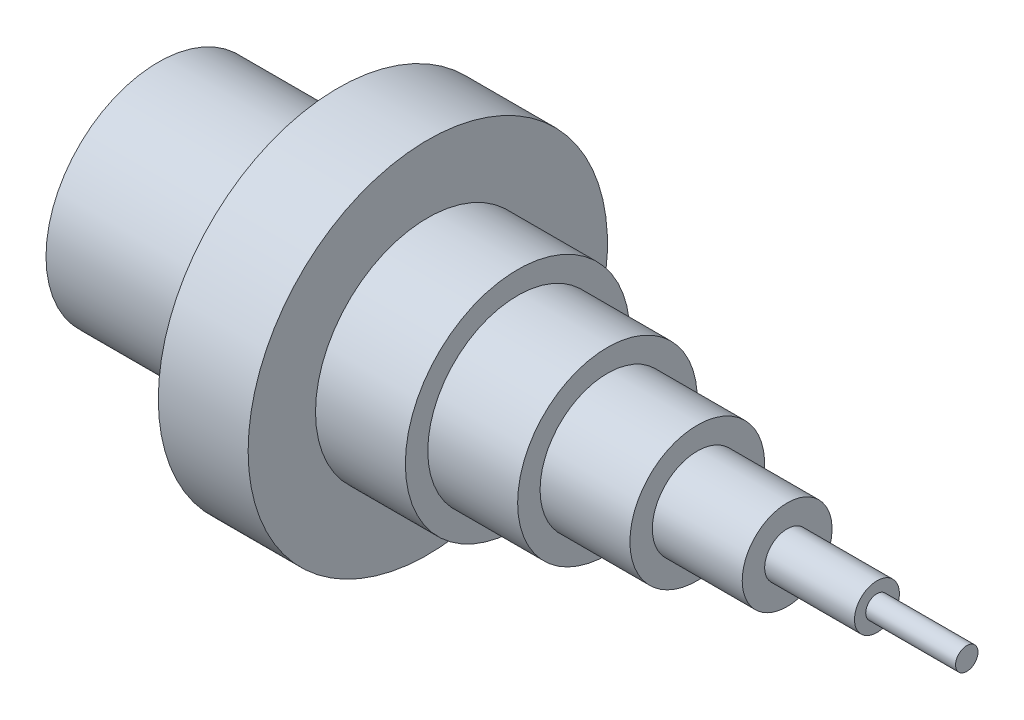
ISO-10303-21;
HEADER;
FILE_DESCRIPTION(('STEP AP214'),'2;1');
FILE_NAME('part.step','',(''),(''),'','','');
FILE_SCHEMA(('AUTOMOTIVE_DESIGN { 1 0 10303 214 1 1 1 1 }'));
ENDSEC;
DATA;
#1=APPLICATION_CONTEXT('core data for automotive mechanical design processes');
#2=APPLICATION_PROTOCOL_DEFINITION('international standard','automotive_design',2000,#1);
#3=PRODUCT_CONTEXT('',#1,'mechanical');
#4=PRODUCT('Part','Part','',(#3));
#5=PRODUCT_RELATED_PRODUCT_CATEGORY('part','',(#4));
#6=PRODUCT_DEFINITION_FORMATION('','',#4);
#7=PRODUCT_DEFINITION_CONTEXT('part definition',#1,'design');
#8=PRODUCT_DEFINITION('design','',#6,#7);
#9=PRODUCT_DEFINITION_SHAPE('','',#8);
#10=(LENGTH_UNIT() NAMED_UNIT(*) SI_UNIT(.MILLI.,.METRE.));
#11=(NAMED_UNIT(*) PLANE_ANGLE_UNIT() SI_UNIT($,.RADIAN.));
#12=(NAMED_UNIT(*) SI_UNIT($,.STERADIAN.) SOLID_ANGLE_UNIT());
#13=UNCERTAINTY_MEASURE_WITH_UNIT(LENGTH_MEASURE(1.E-05),#10,'distance_accuracy_value','');
#14=(GEOMETRIC_REPRESENTATION_CONTEXT(3) GLOBAL_UNCERTAINTY_ASSIGNED_CONTEXT((#13)) GLOBAL_UNIT_ASSIGNED_CONTEXT((#10,
#11,#12)) REPRESENTATION_CONTEXT('',''));
#15=CARTESIAN_POINT('',(0.,0.,0.));
#16=DIRECTION('',(0.,0.,1.));
#17=DIRECTION('',(1.,0.,0.));
#18=AXIS2_PLACEMENT_3D('',#15,#16,#17);
#19=CARTESIAN_POINT('',(0.,0.,0.));
#20=DIRECTION('',(1.,0.,0.));
#21=DIRECTION('',(0.,0.,-1.));
#22=AXIS2_PLACEMENT_3D('',#19,#20,#21);
#23=PLANE('',#22);
#24=CARTESIAN_POINT('',(0.,0.,0.));
#25=DIRECTION('',(-1.,0.,0.));
#26=DIRECTION('',(0.,0.,1.));
#27=AXIS2_PLACEMENT_3D('',#24,#25,#26);
#28=CIRCLE('',#27,20.);
#29=CARTESIAN_POINT('',(0.,0.,20.));
#30=VERTEX_POINT('',#29);
#31=EDGE_CURVE('E89',#30,#30,#28,.T.);
#32=ORIENTED_EDGE('',*,*,#31,.F.);
#33=EDGE_LOOP('',(#32));
#34=FACE_BOUND('',#33,.T.);
#35=CARTESIAN_POINT('',(0.,0.,0.));
#36=DIRECTION('',(-1.,0.,0.));
#37=DIRECTION('',(0.,0.,1.));
#38=AXIS2_PLACEMENT_3D('',#35,#36,#37);
#39=CIRCLE('',#38,25.);
#40=CARTESIAN_POINT('',(0.,0.,25.));
#41=VERTEX_POINT('',#40);
#42=EDGE_CURVE('E10',#41,#41,#39,.T.);
#43=ORIENTED_EDGE('',*,*,#42,.T.);
#44=EDGE_LOOP('',(#43));
#45=FACE_BOUND('',#44,.T.);
#46=ADVANCED_FACE('F33',(#34,#45),#23,.F.);
#47=CARTESIAN_POINT('',(-116.666666666667,0.,0.));
#48=DIRECTION('',(-1.,0.,0.));
#49=DIRECTION('',(0.,0.,1.));
#50=AXIS2_PLACEMENT_3D('',#47,#48,#49);
#51=CYLINDRICAL_SURFACE('',#50,25.);
#52=ORIENTED_EDGE('',*,*,#42,.F.);
#53=EDGE_LOOP('',(#52));
#54=FACE_BOUND('',#53,.T.);
#55=CARTESIAN_POINT('',(40.,0.,0.));
#56=DIRECTION('',(-1.,0.,0.));
#57=DIRECTION('',(0.,0.,1.));
#58=AXIS2_PLACEMENT_3D('',#55,#56,#57);
#59=CIRCLE('',#58,25.);
#60=CARTESIAN_POINT('',(40.,0.,25.));
#61=VERTEX_POINT('',#60);
#62=EDGE_CURVE('E39',#61,#61,#59,.T.);
#63=ORIENTED_EDGE('',*,*,#62,.T.);
#64=EDGE_LOOP('',(#63));
#65=FACE_BOUND('',#64,.T.);
#66=ADVANCED_FACE('F105',(#54,#65),#51,.T.);
#67=CARTESIAN_POINT('',(40.,25.,0.));
#68=DIRECTION('',(1.,0.,0.));
#69=DIRECTION('',(0.,0.,-1.));
#70=AXIS2_PLACEMENT_3D('',#67,#68,#69);
#71=PLANE('',#70);
#72=ORIENTED_EDGE('',*,*,#62,.F.);
#73=EDGE_LOOP('',(#72));
#74=FACE_BOUND('',#73,.T.);
#75=CARTESIAN_POINT('',(40.,0.,0.));
#76=DIRECTION('',(-1.,0.,0.));
#77=DIRECTION('',(0.,0.,1.));
#78=AXIS2_PLACEMENT_3D('',#75,#76,#77);
#79=CIRCLE('',#78,40.);
#80=CARTESIAN_POINT('',(40.,0.,40.));
#81=VERTEX_POINT('',#80);
#82=EDGE_CURVE('E43',#81,#81,#79,.T.);
#83=ORIENTED_EDGE('',*,*,#82,.T.);
#84=EDGE_LOOP('',(#83));
#85=FACE_BOUND('',#84,.T.);
#86=ADVANCED_FACE('F109',(#74,#85),#71,.F.);
#87=CARTESIAN_POINT('',(-116.666666666667,0.,0.));
#88=DIRECTION('',(-1.,0.,0.));
#89=DIRECTION('',(0.,0.,1.));
#90=AXIS2_PLACEMENT_3D('',#87,#88,#89);
#91=CYLINDRICAL_SURFACE('',#90,40.);
#92=ORIENTED_EDGE('',*,*,#82,.F.);
#93=EDGE_LOOP('',(#92));
#94=FACE_BOUND('',#93,.T.);
#95=CARTESIAN_POINT('',(60.,0.,0.));
#96=DIRECTION('',(-1.,0.,0.));
#97=DIRECTION('',(0.,0.,1.));
#98=AXIS2_PLACEMENT_3D('',#95,#96,#97);
#99=CIRCLE('',#98,40.);
#100=CARTESIAN_POINT('',(60.,0.,40.));
#101=VERTEX_POINT('',#100);
#102=EDGE_CURVE('E47',#101,#101,#99,.T.);
#103=ORIENTED_EDGE('',*,*,#102,.T.);
#104=EDGE_LOOP('',(#103));
#105=FACE_BOUND('',#104,.T.);
#106=ADVANCED_FACE('F114',(#94,#105),#91,.T.);
#107=CARTESIAN_POINT('',(60.,40.,0.));
#108=DIRECTION('',(-1.,0.,0.));
#109=DIRECTION('',(0.,0.,1.));
#110=AXIS2_PLACEMENT_3D('',#107,#108,#109);
#111=PLANE('',#110);
#112=ORIENTED_EDGE('',*,*,#102,.F.);
#113=EDGE_LOOP('',(#112));
#114=FACE_BOUND('',#113,.T.);
#115=CARTESIAN_POINT('',(60.,0.,0.));
#116=DIRECTION('',(-1.,0.,0.));
#117=DIRECTION('',(0.,0.,1.));
#118=AXIS2_PLACEMENT_3D('',#115,#116,#117);
#119=CIRCLE('',#118,25.);
#120=CARTESIAN_POINT('',(60.,0.,25.));
#121=VERTEX_POINT('',#120);
#122=EDGE_CURVE('E52',#121,#121,#119,.T.);
#123=ORIENTED_EDGE('',*,*,#122,.T.);
#124=EDGE_LOOP('',(#123));
#125=FACE_BOUND('',#124,.T.);
#126=ADVANCED_FACE('F120',(#114,#125),#111,.F.);
#127=CARTESIAN_POINT('',(-116.666666666667,0.,0.));
#128=DIRECTION('',(-1.,0.,0.));
#129=DIRECTION('',(0.,0.,1.));
#130=AXIS2_PLACEMENT_3D('',#127,#128,#129);
#131=CYLINDRICAL_SURFACE('',#130,25.);
#132=ORIENTED_EDGE('',*,*,#122,.F.);
#133=EDGE_LOOP('',(#132));
#134=FACE_BOUND('',#133,.T.);
#135=CARTESIAN_POINT('',(80.,0.,0.));
#136=DIRECTION('',(-1.,0.,0.));
#137=DIRECTION('',(0.,0.,1.));
#138=AXIS2_PLACEMENT_3D('',#135,#136,#137);
#139=CIRCLE('',#138,25.);
#140=CARTESIAN_POINT('',(80.,0.,25.));
#141=VERTEX_POINT('',#140);
#142=EDGE_CURVE('E55',#141,#141,#139,.T.);
#143=ORIENTED_EDGE('',*,*,#142,.T.);
#144=EDGE_LOOP('',(#143));
#145=FACE_BOUND('',#144,.T.);
#146=ADVANCED_FACE('F124',(#134,#145),#131,.T.);
#147=CARTESIAN_POINT('',(80.,25.,0.));
#148=DIRECTION('',(-1.,0.,0.));
#149=DIRECTION('',(0.,0.,1.));
#150=AXIS2_PLACEMENT_3D('',#147,#148,#149);
#151=PLANE('',#150);
#152=ORIENTED_EDGE('',*,*,#142,.F.);
#153=EDGE_LOOP('',(#152));
#154=FACE_BOUND('',#153,.T.);
#155=CARTESIAN_POINT('',(80.,0.,0.));
#156=DIRECTION('',(-1.,0.,0.));
#157=DIRECTION('',(0.,0.,1.));
#158=AXIS2_PLACEMENT_3D('',#155,#156,#157);
#159=CIRCLE('',#158,20.);
#160=CARTESIAN_POINT('',(80.,0.,20.));
#161=VERTEX_POINT('',#160);
#162=EDGE_CURVE('E58',#161,#161,#159,.T.);
#163=ORIENTED_EDGE('',*,*,#162,.T.);
#164=EDGE_LOOP('',(#163));
#165=FACE_BOUND('',#164,.T.);
#166=ADVANCED_FACE('F128',(#154,#165),#151,.F.);
#167=CARTESIAN_POINT('',(-116.666666666667,0.,0.));
#168=DIRECTION('',(-1.,0.,0.));
#169=DIRECTION('',(0.,0.,1.));
#170=AXIS2_PLACEMENT_3D('',#167,#168,#169);
#171=CYLINDRICAL_SURFACE('',#170,20.);
#172=ORIENTED_EDGE('',*,*,#162,.F.);
#173=EDGE_LOOP('',(#172));
#174=FACE_BOUND('',#173,.T.);
#175=CARTESIAN_POINT('',(100.,0.,0.));
#176=DIRECTION('',(-1.,0.,0.));
#177=DIRECTION('',(0.,0.,1.));
#178=AXIS2_PLACEMENT_3D('',#175,#176,#177);
#179=CIRCLE('',#178,20.);
#180=CARTESIAN_POINT('',(100.,0.,20.));
#181=VERTEX_POINT('',#180);
#182=EDGE_CURVE('E61',#181,#181,#179,.T.);
#183=ORIENTED_EDGE('',*,*,#182,.T.);
#184=EDGE_LOOP('',(#183));
#185=FACE_BOUND('',#184,.T.);
#186=ADVANCED_FACE('F132',(#174,#185),#171,.T.);
#187=CARTESIAN_POINT('',(100.,20.,0.));
#188=DIRECTION('',(-1.,0.,0.));
#189=DIRECTION('',(0.,0.,1.));
#190=AXIS2_PLACEMENT_3D('',#187,#188,#189);
#191=PLANE('',#190);
#192=ORIENTED_EDGE('',*,*,#182,.F.);
#193=EDGE_LOOP('',(#192));
#194=FACE_BOUND('',#193,.T.);
#195=CARTESIAN_POINT('',(100.,0.,0.));
#196=DIRECTION('',(-1.,0.,0.));
#197=DIRECTION('',(0.,0.,1.));
#198=AXIS2_PLACEMENT_3D('',#195,#196,#197);
#199=CIRCLE('',#198,15.);
#200=CARTESIAN_POINT('',(100.,0.,15.));
#201=VERTEX_POINT('',#200);
#202=EDGE_CURVE('E64',#201,#201,#199,.T.);
#203=ORIENTED_EDGE('',*,*,#202,.T.);
#204=EDGE_LOOP('',(#203));
#205=FACE_BOUND('',#204,.T.);
#206=ADVANCED_FACE('F136',(#194,#205),#191,.F.);
#207=CARTESIAN_POINT('',(-116.666666666667,0.,0.));
#208=DIRECTION('',(-1.,0.,0.));
#209=DIRECTION('',(0.,0.,1.));
#210=AXIS2_PLACEMENT_3D('',#207,#208,#209);
#211=CYLINDRICAL_SURFACE('',#210,15.);
#212=ORIENTED_EDGE('',*,*,#202,.F.);
#213=EDGE_LOOP('',(#212));
#214=FACE_BOUND('',#213,.T.);
#215=CARTESIAN_POINT('',(120.,0.,0.));
#216=DIRECTION('',(-1.,0.,0.));
#217=DIRECTION('',(0.,0.,1.));
#218=AXIS2_PLACEMENT_3D('',#215,#216,#217);
#219=CIRCLE('',#218,15.);
#220=CARTESIAN_POINT('',(120.,0.,15.));
#221=VERTEX_POINT('',#220);
#222=EDGE_CURVE('E67',#221,#221,#219,.T.);
#223=ORIENTED_EDGE('',*,*,#222,.T.);
#224=EDGE_LOOP('',(#223));
#225=FACE_BOUND('',#224,.T.);
#226=ADVANCED_FACE('F140',(#214,#225),#211,.T.);
#227=CARTESIAN_POINT('',(120.,15.,0.));
#228=DIRECTION('',(-1.,0.,0.));
#229=DIRECTION('',(0.,0.,1.));
#230=AXIS2_PLACEMENT_3D('',#227,#228,#229);
#231=PLANE('',#230);
#232=ORIENTED_EDGE('',*,*,#222,.F.);
#233=EDGE_LOOP('',(#232));
#234=FACE_BOUND('',#233,.T.);
#235=CARTESIAN_POINT('',(120.,0.,0.));
#236=DIRECTION('',(-1.,0.,0.));
#237=DIRECTION('',(0.,0.,1.));
#238=AXIS2_PLACEMENT_3D('',#235,#236,#237);
#239=CIRCLE('',#238,10.);
#240=CARTESIAN_POINT('',(120.,0.,10.));
#241=VERTEX_POINT('',#240);
#242=EDGE_CURVE('E70',#241,#241,#239,.T.);
#243=ORIENTED_EDGE('',*,*,#242,.T.);
#244=EDGE_LOOP('',(#243));
#245=FACE_BOUND('',#244,.T.);
#246=ADVANCED_FACE('F144',(#234,#245),#231,.F.);
#247=CARTESIAN_POINT('',(-116.666666666667,0.,0.));
#248=DIRECTION('',(-1.,0.,0.));
#249=DIRECTION('',(0.,0.,1.));
#250=AXIS2_PLACEMENT_3D('',#247,#248,#249);
#251=CYLINDRICAL_SURFACE('',#250,10.);
#252=ORIENTED_EDGE('',*,*,#242,.F.);
#253=EDGE_LOOP('',(#252));
#254=FACE_BOUND('',#253,.T.);
#255=CARTESIAN_POINT('',(140.,0.,0.));
#256=DIRECTION('',(-1.,0.,0.));
#257=DIRECTION('',(0.,0.,1.));
#258=AXIS2_PLACEMENT_3D('',#255,#256,#257);
#259=CIRCLE('',#258,10.);
#260=CARTESIAN_POINT('',(140.,0.,10.));
#261=VERTEX_POINT('',#260);
#262=EDGE_CURVE('E73',#261,#261,#259,.T.);
#263=ORIENTED_EDGE('',*,*,#262,.T.);
#264=EDGE_LOOP('',(#263));
#265=FACE_BOUND('',#264,.T.);
#266=ADVANCED_FACE('F148',(#254,#265),#251,.T.);
#267=CARTESIAN_POINT('',(140.,10.,0.));
#268=DIRECTION('',(-1.,0.,0.));
#269=DIRECTION('',(0.,0.,1.));
#270=AXIS2_PLACEMENT_3D('',#267,#268,#269);
#271=PLANE('',#270);
#272=ORIENTED_EDGE('',*,*,#262,.F.);
#273=EDGE_LOOP('',(#272));
#274=FACE_BOUND('',#273,.T.);
#275=CARTESIAN_POINT('',(140.,0.,0.));
#276=DIRECTION('',(-1.,0.,0.));
#277=DIRECTION('',(0.,0.,1.));
#278=AXIS2_PLACEMENT_3D('',#275,#276,#277);
#279=CIRCLE('',#278,5.);
#280=CARTESIAN_POINT('',(140.,0.,5.));
#281=VERTEX_POINT('',#280);
#282=EDGE_CURVE('E76',#281,#281,#279,.T.);
#283=ORIENTED_EDGE('',*,*,#282,.T.);
#284=EDGE_LOOP('',(#283));
#285=FACE_BOUND('',#284,.T.);
#286=ADVANCED_FACE('F152',(#274,#285),#271,.F.);
#287=CARTESIAN_POINT('',(-116.666666666667,0.,0.));
#288=DIRECTION('',(-1.,0.,0.));
#289=DIRECTION('',(0.,0.,1.));
#290=AXIS2_PLACEMENT_3D('',#287,#288,#289);
#291=CYLINDRICAL_SURFACE('',#290,5.);
#292=ORIENTED_EDGE('',*,*,#282,.F.);
#293=EDGE_LOOP('',(#292));
#294=FACE_BOUND('',#293,.T.);
#295=CARTESIAN_POINT('',(160.,0.,0.));
#296=DIRECTION('',(-1.,0.,0.));
#297=DIRECTION('',(0.,0.,1.));
#298=AXIS2_PLACEMENT_3D('',#295,#296,#297);
#299=CIRCLE('',#298,5.);
#300=CARTESIAN_POINT('',(160.,0.,5.));
#301=VERTEX_POINT('',#300);
#302=EDGE_CURVE('E79',#301,#301,#299,.T.);
#303=ORIENTED_EDGE('',*,*,#302,.T.);
#304=EDGE_LOOP('',(#303));
#305=FACE_BOUND('',#304,.T.);
#306=ADVANCED_FACE('F156',(#294,#305),#291,.T.);
#307=CARTESIAN_POINT('',(160.,5.,0.));
#308=DIRECTION('',(-1.,0.,0.));
#309=DIRECTION('',(0.,0.,1.));
#310=AXIS2_PLACEMENT_3D('',#307,#308,#309);
#311=PLANE('',#310);
#312=ORIENTED_EDGE('',*,*,#302,.F.);
#313=EDGE_LOOP('',(#312));
#314=FACE_BOUND('',#313,.T.);
#315=CARTESIAN_POINT('',(160.,0.,0.));
#316=DIRECTION('',(-1.,0.,0.));
#317=DIRECTION('',(0.,0.,1.));
#318=AXIS2_PLACEMENT_3D('',#315,#316,#317);
#319=CIRCLE('',#318,2.5);
#320=CARTESIAN_POINT('',(160.,0.,2.5));
#321=VERTEX_POINT('',#320);
#322=EDGE_CURVE('E82',#321,#321,#319,.T.);
#323=ORIENTED_EDGE('',*,*,#322,.T.);
#324=EDGE_LOOP('',(#323));
#325=FACE_BOUND('',#324,.T.);
#326=ADVANCED_FACE('F160',(#314,#325),#311,.F.);
#327=CARTESIAN_POINT('',(-116.666666666667,0.,0.));
#328=DIRECTION('',(-1.,0.,0.));
#329=DIRECTION('',(0.,0.,1.));
#330=AXIS2_PLACEMENT_3D('',#327,#328,#329);
#331=CYLINDRICAL_SURFACE('',#330,2.5);
#332=ORIENTED_EDGE('',*,*,#322,.F.);
#333=EDGE_LOOP('',(#332));
#334=FACE_BOUND('',#333,.T.);
#335=CARTESIAN_POINT('',(180.,0.,0.));
#336=DIRECTION('',(-1.,0.,0.));
#337=DIRECTION('',(0.,0.,1.));
#338=AXIS2_PLACEMENT_3D('',#335,#336,#337);
#339=CIRCLE('',#338,2.5);
#340=CARTESIAN_POINT('',(180.,0.,2.5));
#341=VERTEX_POINT('',#340);
#342=EDGE_CURVE('E85',#341,#341,#339,.T.);
#343=ORIENTED_EDGE('',*,*,#342,.T.);
#344=EDGE_LOOP('',(#343));
#345=FACE_BOUND('',#344,.T.);
#346=ADVANCED_FACE('F164',(#334,#345),#331,.T.);
#347=CARTESIAN_POINT('',(180.,2.5,0.));
#348=DIRECTION('',(-1.,0.,0.));
#349=DIRECTION('',(0.,0.,1.));
#350=AXIS2_PLACEMENT_3D('',#347,#348,#349);
#351=PLANE('',#350);
#352=ORIENTED_EDGE('',*,*,#342,.F.);
#353=EDGE_LOOP('',(#352));
#354=FACE_BOUND('',#353,.T.);
#355=ADVANCED_FACE('F100',(#354),#351,.F.);
#356=CARTESIAN_POINT('',(40.,0.,0.));
#357=DIRECTION('',(-1.,0.,0.));
#358=DIRECTION('',(0.,0.,1.));
#359=AXIS2_PLACEMENT_3D('',#356,#357,#358);
#360=CYLINDRICAL_SURFACE('',#359,20.);
#361=CARTESIAN_POINT('',(40.,0.,0.));
#362=DIRECTION('',(-1.,0.,0.));
#363=DIRECTION('',(0.,0.,1.));
#364=AXIS2_PLACEMENT_3D('',#361,#362,#363);
#365=CIRCLE('',#364,20.);
#366=CARTESIAN_POINT('',(40.,0.,20.));
#367=VERTEX_POINT('',#366);
#368=EDGE_CURVE('E88',#367,#367,#365,.T.);
#369=ORIENTED_EDGE('',*,*,#368,.F.);
#370=EDGE_LOOP('',(#369));
#371=FACE_BOUND('',#370,.T.);
#372=ORIENTED_EDGE('',*,*,#31,.T.);
#373=EDGE_LOOP('',(#372));
#374=FACE_BOUND('',#373,.T.);
#375=ADVANCED_FACE('F97',(#371,#374),#360,.F.);
#376=CARTESIAN_POINT('',(40.,0.,0.));
#377=DIRECTION('',(-1.,0.,0.));
#378=DIRECTION('',(0.,0.,1.));
#379=AXIS2_PLACEMENT_3D('',#376,#377,#378);
#380=PLANE('',#379);
#381=ORIENTED_EDGE('',*,*,#368,.T.);
#382=EDGE_LOOP('',(#381));
#383=FACE_BOUND('',#382,.T.);
#384=ADVANCED_FACE('F95',(#383),#380,.T.);
#385=CLOSED_SHELL('',(#46,#66,#86,#106,#126,#146,#166,#186,#206,#226,#246,#266,#286,#306,#326,
#346,#355,#375,#384));
#386=MANIFOLD_SOLID_BREP('B2',#385);
#387=ADVANCED_BREP_SHAPE_REPRESENTATION('',(#18,#386),#14);
#388=SHAPE_DEFINITION_REPRESENTATION(#9,#387);
ENDSEC;
END-ISO-10303-21;
